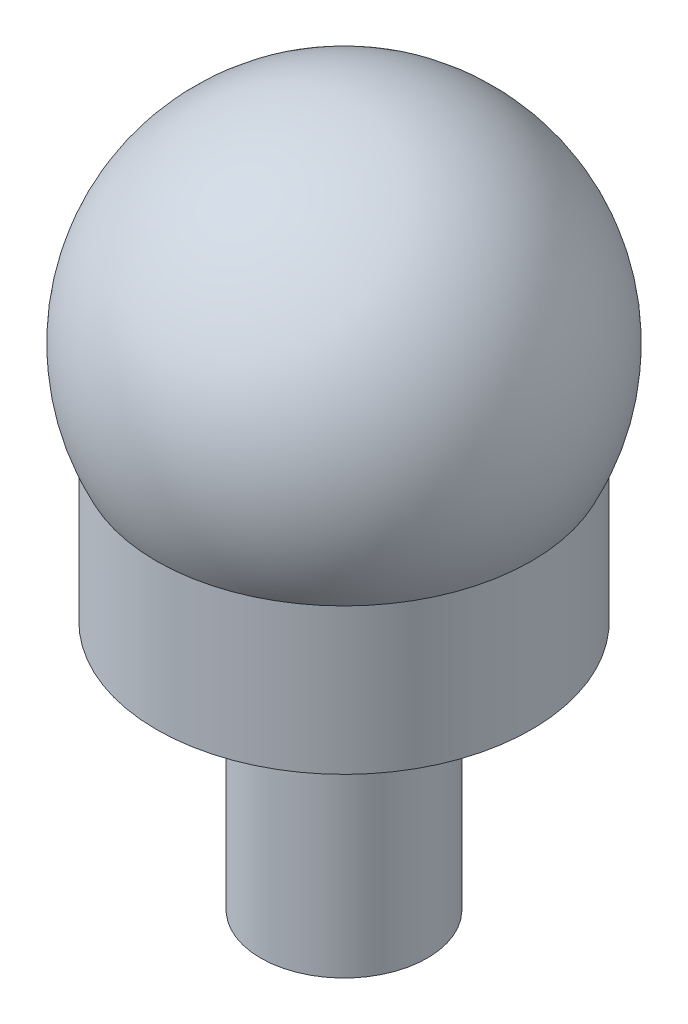
ISO-10303-21;
HEADER;
FILE_DESCRIPTION(('STEP AP214'),'2;1');
FILE_NAME('part.step','',(''),(''),'','','');
FILE_SCHEMA(('AUTOMOTIVE_DESIGN { 1 0 10303 214 1 1 1 1 }'));
ENDSEC;
DATA;
#1=APPLICATION_CONTEXT('core data for automotive mechanical design processes');
#2=APPLICATION_PROTOCOL_DEFINITION('international standard','automotive_design',2000,#1);
#3=PRODUCT_CONTEXT('',#1,'mechanical');
#4=PRODUCT('Part','Part','',(#3));
#5=PRODUCT_RELATED_PRODUCT_CATEGORY('part','',(#4));
#6=PRODUCT_DEFINITION_FORMATION('','',#4);
#7=PRODUCT_DEFINITION_CONTEXT('part definition',#1,'design');
#8=PRODUCT_DEFINITION('design','',#6,#7);
#9=PRODUCT_DEFINITION_SHAPE('','',#8);
#10=(LENGTH_UNIT() NAMED_UNIT(*) SI_UNIT(.MILLI.,.METRE.));
#11=(NAMED_UNIT(*) PLANE_ANGLE_UNIT() SI_UNIT($,.RADIAN.));
#12=(NAMED_UNIT(*) SI_UNIT($,.STERADIAN.) SOLID_ANGLE_UNIT());
#13=UNCERTAINTY_MEASURE_WITH_UNIT(LENGTH_MEASURE(1.E-05),#10,'distance_accuracy_value','');
#14=(GEOMETRIC_REPRESENTATION_CONTEXT(3) GLOBAL_UNCERTAINTY_ASSIGNED_CONTEXT((#13)) GLOBAL_UNIT_ASSIGNED_CONTEXT((#10,
#11,#12)) REPRESENTATION_CONTEXT('',''));
#15=CARTESIAN_POINT('',(0.,0.,0.));
#16=DIRECTION('',(0.,0.,1.));
#17=DIRECTION('',(1.,0.,0.));
#18=AXIS2_PLACEMENT_3D('',#15,#16,#17);
#19=CARTESIAN_POINT('',(0.,12.,0.));
#20=DIRECTION('',(0.,-1.,0.));
#21=DIRECTION('',(0.,0.,-1.));
#22=AXIS2_PLACEMENT_3D('',#19,#20,#21);
#23=CYLINDRICAL_SURFACE('',#22,4.);
#24=CARTESIAN_POINT('',(0.,12.,0.));
#25=DIRECTION('',(0.,1.,0.));
#26=DIRECTION('',(0.,0.,1.));
#27=AXIS2_PLACEMENT_3D('',#24,#25,#26);
#28=CIRCLE('',#27,4.);
#29=CARTESIAN_POINT('',(0.,12.,4.));
#30=VERTEX_POINT('',#29);
#31=EDGE_CURVE('E10',#30,#30,#28,.T.);
#32=ORIENTED_EDGE('',*,*,#31,.F.);
#33=EDGE_LOOP('',(#32));
#34=FACE_BOUND('',#33,.T.);
#35=CARTESIAN_POINT('',(0.,0.,0.));
#36=DIRECTION('',(0.,1.,0.));
#37=DIRECTION('',(0.,0.,1.));
#38=AXIS2_PLACEMENT_3D('',#35,#36,#37);
#39=CIRCLE('',#38,4.);
#40=CARTESIAN_POINT('',(0.,0.,4.));
#41=VERTEX_POINT('',#40);
#42=EDGE_CURVE('E36',#41,#41,#39,.T.);
#43=ORIENTED_EDGE('',*,*,#42,.T.);
#44=EDGE_LOOP('',(#43));
#45=FACE_BOUND('',#44,.T.);
#46=ADVANCED_FACE('F33',(#34,#45),#23,.T.);
#47=CARTESIAN_POINT('',(0.,0.,0.));
#48=DIRECTION('',(0.,1.,0.));
#49=DIRECTION('',(0.,0.,1.));
#50=AXIS2_PLACEMENT_3D('',#47,#48,#49);
#51=PLANE('',#50);
#52=ORIENTED_EDGE('',*,*,#42,.F.);
#53=EDGE_LOOP('',(#52));
#54=FACE_BOUND('',#53,.T.);
#55=ADVANCED_FACE('F57',(#54),#51,.F.);
#56=CARTESIAN_POINT('',(0.,19.,0.));
#57=DIRECTION('',(0.,-1.,0.));
#58=DIRECTION('',(0.,0.,-1.));
#59=AXIS2_PLACEMENT_3D('',#56,#57,#58);
#60=CYLINDRICAL_SURFACE('',#59,8.99999999999999);
#61=CARTESIAN_POINT('',(0.,19.,0.));
#62=DIRECTION('',(0.,1.,0.));
#63=DIRECTION('',(0.,0.,1.));
#64=AXIS2_PLACEMENT_3D('',#61,#62,#63);
#65=CIRCLE('',#64,8.99999999999999);
#66=CARTESIAN_POINT('',(0.,19.,8.99999999999999));
#67=VERTEX_POINT('',#66);
#68=EDGE_CURVE('E43',#67,#67,#65,.T.);
#69=ORIENTED_EDGE('',*,*,#68,.F.);
#70=EDGE_LOOP('',(#69));
#71=FACE_BOUND('',#70,.T.);
#72=CARTESIAN_POINT('',(0.,12.,0.));
#73=DIRECTION('',(0.,1.,0.));
#74=DIRECTION('',(0.,0.,1.));
#75=AXIS2_PLACEMENT_3D('',#72,#73,#74);
#76=CIRCLE('',#75,8.99999999999999);
#77=CARTESIAN_POINT('',(0.,12.,8.99999999999999));
#78=VERTEX_POINT('',#77);
#79=EDGE_CURVE('E45',#78,#78,#76,.T.);
#80=ORIENTED_EDGE('',*,*,#79,.T.);
#81=EDGE_LOOP('',(#80));
#82=FACE_BOUND('',#81,.T.);
#83=ADVANCED_FACE('F53',(#71,#82),#60,.T.);
#84=CARTESIAN_POINT('',(0.,12.,0.));
#85=DIRECTION('',(0.,1.,0.));
#86=DIRECTION('',(0.,0.,1.));
#87=AXIS2_PLACEMENT_3D('',#84,#85,#86);
#88=PLANE('',#87);
#89=ORIENTED_EDGE('',*,*,#31,.T.);
#90=EDGE_LOOP('',(#89));
#91=FACE_BOUND('',#90,.T.);
#92=ORIENTED_EDGE('',*,*,#79,.F.);
#93=EDGE_LOOP('',(#92));
#94=FACE_BOUND('',#93,.T.);
#95=ADVANCED_FACE('F56',(#91,#94),#88,.F.);
#96=CARTESIAN_POINT('',(0.,23.5596930851488,0.));
#97=DIRECTION('',(0.,1.,0.));
#98=DIRECTION('',(1.,0.,0.));
#99=AXIS2_PLACEMENT_3D('',#96,#97,#98);
#100=SPHERICAL_SURFACE('',#99,10.0891427302201);
#101=ORIENTED_EDGE('',*,*,#68,.T.);
#102=EDGE_LOOP('',(#101));
#103=FACE_BOUND('',#102,.T.);
#104=ADVANCED_FACE('F51',(#103),#100,.T.);
#105=CLOSED_SHELL('',(#46,#55,#83,#95,#104));
#106=MANIFOLD_SOLID_BREP('B2',#105);
#107=ADVANCED_BREP_SHAPE_REPRESENTATION('',(#18,#106),#14);
#108=SHAPE_DEFINITION_REPRESENTATION(#9,#107);
ENDSEC;
END-ISO-10303-21;
